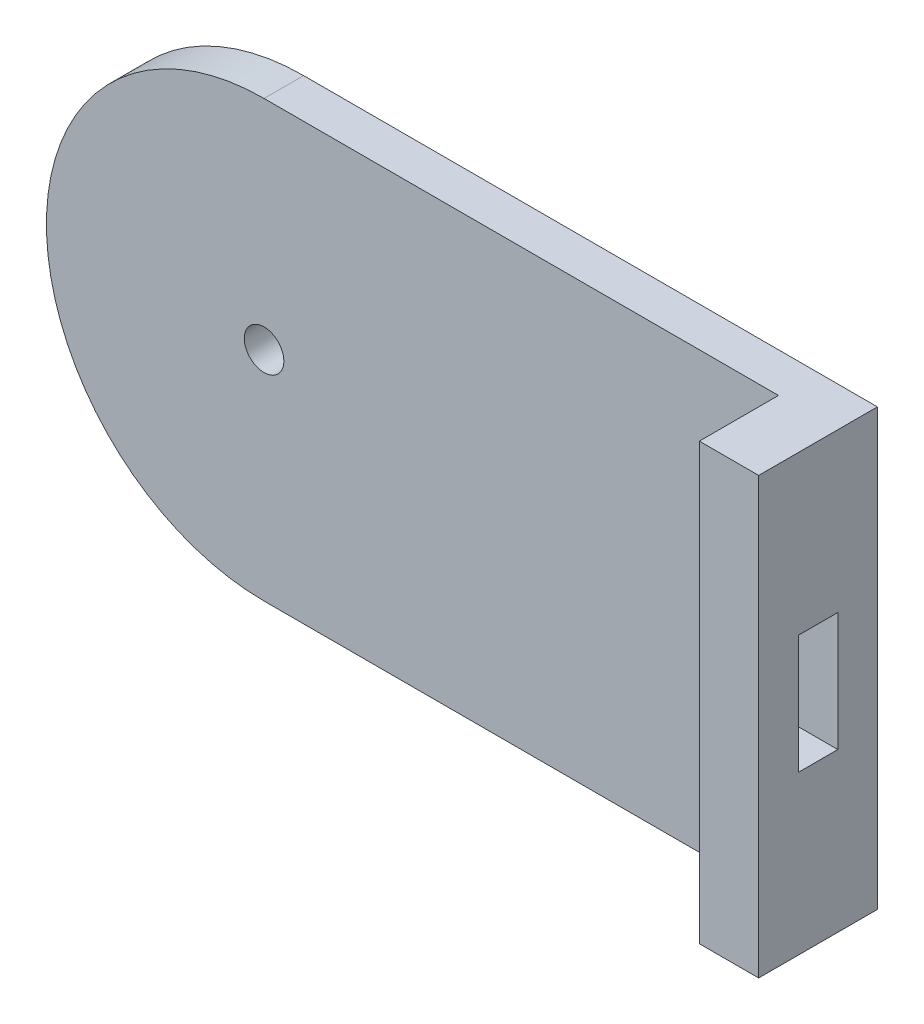
ISO-10303-21;
HEADER;
FILE_DESCRIPTION(('STEP AP214'),'2;1');
FILE_NAME('part.step','',(''),(''),'','','');
FILE_SCHEMA(('AUTOMOTIVE_DESIGN { 1 0 10303 214 1 1 1 1 }'));
ENDSEC;
DATA;
#1=APPLICATION_CONTEXT('core data for automotive mechanical design processes');
#2=APPLICATION_PROTOCOL_DEFINITION('international standard','automotive_design',2000,#1);
#3=PRODUCT_CONTEXT('',#1,'mechanical');
#4=PRODUCT('Part','Part','',(#3));
#5=PRODUCT_RELATED_PRODUCT_CATEGORY('part','',(#4));
#6=PRODUCT_DEFINITION_FORMATION('','',#4);
#7=PRODUCT_DEFINITION_CONTEXT('part definition',#1,'design');
#8=PRODUCT_DEFINITION('design','',#6,#7);
#9=PRODUCT_DEFINITION_SHAPE('','',#8);
#10=(LENGTH_UNIT() NAMED_UNIT(*) SI_UNIT(.MILLI.,.METRE.));
#11=(NAMED_UNIT(*) PLANE_ANGLE_UNIT() SI_UNIT($,.RADIAN.));
#12=(NAMED_UNIT(*) SI_UNIT($,.STERADIAN.) SOLID_ANGLE_UNIT());
#13=UNCERTAINTY_MEASURE_WITH_UNIT(LENGTH_MEASURE(1.E-05),#10,'distance_accuracy_value','');
#14=(GEOMETRIC_REPRESENTATION_CONTEXT(3) GLOBAL_UNCERTAINTY_ASSIGNED_CONTEXT((#13)) GLOBAL_UNIT_ASSIGNED_CONTEXT((#10,
#11,#12)) REPRESENTATION_CONTEXT('',''));
#15=CARTESIAN_POINT('',(0.,0.,0.));
#16=DIRECTION('',(0.,0.,1.));
#17=DIRECTION('',(1.,0.,0.));
#18=AXIS2_PLACEMENT_3D('',#15,#16,#17);
#19=CARTESIAN_POINT('',(-59.8184613478966,-27.822605838421,-10.));
#20=DIRECTION('',(0.,0.,1.));
#21=DIRECTION('',(1.,0.,0.));
#22=AXIS2_PLACEMENT_3D('',#19,#20,#21);
#23=CYLINDRICAL_SURFACE('',#22,55.);
#24=CARTESIAN_POINT('',(-59.8184613478966,-27.822605838421,0.));
#25=DIRECTION('',(0.,0.,1.));
#26=DIRECTION('',(1.,0.,0.));
#27=AXIS2_PLACEMENT_3D('',#24,#25,#26);
#28=CIRCLE('',#27,55.);
#29=CARTESIAN_POINT('',(-59.8184613478966,-82.822605838421,0.));
#30=VERTEX_POINT('',#29);
#31=CARTESIAN_POINT('',(-59.8184613478966,27.177394161579,0.));
#32=VERTEX_POINT('',#31);
#33=EDGE_CURVE('E196',#30,#32,#28,.F.);
#34=ORIENTED_EDGE('',*,*,#33,.T.);
#35=DIRECTION('',(0.,0.,1.));
#36=VECTOR('',#35,1.);
#37=CARTESIAN_POINT('',(-59.8184613478966,27.177394161579,-10.));
#38=LINE('',#37,#36);
#39=CARTESIAN_POINT('',(-59.8184613478966,27.177394161579,-10.));
#40=VERTEX_POINT('',#39);
#41=EDGE_CURVE('E165',#40,#32,#38,.T.);
#42=ORIENTED_EDGE('',*,*,#41,.F.);
#43=CARTESIAN_POINT('',(-59.8184613478966,-27.822605838421,-10.));
#44=DIRECTION('',(0.,0.,1.));
#45=DIRECTION('',(1.,0.,0.));
#46=AXIS2_PLACEMENT_3D('',#43,#44,#45);
#47=CIRCLE('',#46,55.);
#48=CARTESIAN_POINT('',(-59.8184613478966,-82.822605838421,-10.));
#49=VERTEX_POINT('',#48);
#50=EDGE_CURVE('E155',#49,#40,#47,.F.);
#51=ORIENTED_EDGE('',*,*,#50,.F.);
#52=DIRECTION('',(0.,0.,1.));
#53=VECTOR('',#52,1.);
#54=CARTESIAN_POINT('',(-59.8184613478966,-82.822605838421,-10.));
#55=LINE('',#54,#53);
#56=EDGE_CURVE('E200',#49,#30,#55,.T.);
#57=ORIENTED_EDGE('',*,*,#56,.T.);
#58=EDGE_LOOP('',(#34,#42,#51,#57));
#59=FACE_BOUND('',#58,.T.);
#60=ADVANCED_FACE('F34',(#59),#23,.T.);
#61=CARTESIAN_POINT('',(0.,27.177394161579,-10.));
#62=DIRECTION('',(0.,-1.,0.));
#63=DIRECTION('',(1.,0.,0.));
#64=AXIS2_PLACEMENT_3D('',#61,#62,#63);
#65=PLANE('',#64);
#66=DIRECTION('',(1.,0.,0.));
#67=VECTOR('',#66,1.);
#68=CARTESIAN_POINT('',(0.,27.177394161579,0.));
#69=LINE('',#68,#67);
#70=CARTESIAN_POINT('',(70.1815386521034,27.177394161579,0.));
#71=VERTEX_POINT('',#70);
#72=EDGE_CURVE('E205',#32,#71,#69,.T.);
#73=ORIENTED_EDGE('',*,*,#72,.T.);
#74=DIRECTION('',(0.,0.,-1.));
#75=VECTOR('',#74,1.);
#76=CARTESIAN_POINT('',(70.1815386521034,27.177394161579,20.));
#77=LINE('',#76,#75);
#78=CARTESIAN_POINT('',(70.1815386521034,27.177394161579,20.));
#79=VERTEX_POINT('',#78);
#80=EDGE_CURVE('E203',#79,#71,#77,.T.);
#81=ORIENTED_EDGE('',*,*,#80,.F.);
#82=DIRECTION('',(1.,0.,0.));
#83=VECTOR('',#82,1.);
#84=CARTESIAN_POINT('',(0.,27.177394161579,20.));
#85=LINE('',#84,#83);
#86=CARTESIAN_POINT('',(85.1815386521033,27.177394161579,20.));
#87=VERTEX_POINT('',#86);
#88=EDGE_CURVE('E140',#79,#87,#85,.T.);
#89=ORIENTED_EDGE('',*,*,#88,.T.);
#90=DIRECTION('',(0.,0.,1.));
#91=VECTOR('',#90,1.);
#92=CARTESIAN_POINT('',(85.1815386521033,27.177394161579,-10.));
#93=LINE('',#92,#91);
#94=CARTESIAN_POINT('',(85.1815386521033,27.177394161579,-10.));
#95=VERTEX_POINT('',#94);
#96=EDGE_CURVE('E232',#95,#87,#93,.T.);
#97=ORIENTED_EDGE('',*,*,#96,.F.);
#98=DIRECTION('',(1.,0.,0.));
#99=VECTOR('',#98,1.);
#100=CARTESIAN_POINT('',(0.,27.177394161579,-10.));
#101=LINE('',#100,#99);
#102=EDGE_CURVE('E234',#40,#95,#101,.T.);
#103=ORIENTED_EDGE('',*,*,#102,.F.);
#104=ORIENTED_EDGE('',*,*,#41,.T.);
#105=EDGE_LOOP('',(#73,#81,#89,#97,#103,#104));
#106=FACE_BOUND('',#105,.T.);
#107=ADVANCED_FACE('F185',(#106),#65,.F.);
#108=CARTESIAN_POINT('',(85.1815386521033,0.,-10.));
#109=DIRECTION('',(-1.,0.,0.));
#110=DIRECTION('',(0.,-1.,0.));
#111=AXIS2_PLACEMENT_3D('',#108,#109,#110);
#112=PLANE('',#111);
#113=DIRECTION('',(0.,1.,0.));
#114=VECTOR('',#113,1.);
#115=CARTESIAN_POINT('',(85.1815386521034,-42.822605838421,0.));
#116=LINE('',#115,#114);
#117=CARTESIAN_POINT('',(85.1815386521034,-42.822605838421,0.));
#118=VERTEX_POINT('',#117);
#119=CARTESIAN_POINT('',(85.1815386521033,-12.822605838421,0.));
#120=VERTEX_POINT('',#119);
#121=EDGE_CURVE('E121',#118,#120,#116,.T.);
#122=ORIENTED_EDGE('',*,*,#121,.F.);
#123=DIRECTION('',(0.,0.,-1.));
#124=VECTOR('',#123,1.);
#125=CARTESIAN_POINT('',(85.1815386521034,-42.822605838421,10.));
#126=LINE('',#125,#124);
#127=CARTESIAN_POINT('',(85.1815386521034,-42.822605838421,10.));
#128=VERTEX_POINT('',#127);
#129=EDGE_CURVE('E48',#128,#118,#126,.T.);
#130=ORIENTED_EDGE('',*,*,#129,.F.);
#131=DIRECTION('',(0.,-1.,0.));
#132=VECTOR('',#131,1.);
#133=CARTESIAN_POINT('',(85.1815386521033,-12.822605838421,10.));
#134=LINE('',#133,#132);
#135=CARTESIAN_POINT('',(85.1815386521033,-12.822605838421,10.));
#136=VERTEX_POINT('',#135);
#137=EDGE_CURVE('E130',#136,#128,#134,.T.);
#138=ORIENTED_EDGE('',*,*,#137,.F.);
#139=DIRECTION('',(0.,0.,1.));
#140=VECTOR('',#139,1.);
#141=CARTESIAN_POINT('',(85.1815386521033,-12.822605838421,10.));
#142=LINE('',#141,#140);
#143=EDGE_CURVE('E112',#120,#136,#142,.T.);
#144=ORIENTED_EDGE('',*,*,#143,.F.);
#145=EDGE_LOOP('',(#122,#130,#138,#144));
#146=FACE_BOUND('',#145,.T.);
#147=ORIENTED_EDGE('',*,*,#96,.T.);
#148=DIRECTION('',(0.,-1.,0.));
#149=VECTOR('',#148,1.);
#150=CARTESIAN_POINT('',(85.1815386521033,0.,20.));
#151=LINE('',#150,#149);
#152=CARTESIAN_POINT('',(85.1815386521034,-82.822605838421,20.));
#153=VERTEX_POINT('',#152);
#154=EDGE_CURVE('E149',#87,#153,#151,.T.);
#155=ORIENTED_EDGE('',*,*,#154,.T.);
#156=DIRECTION('',(0.,0.,1.));
#157=VECTOR('',#156,1.);
#158=CARTESIAN_POINT('',(85.1815386521034,-82.822605838421,-10.));
#159=LINE('',#158,#157);
#160=CARTESIAN_POINT('',(85.1815386521034,-82.822605838421,-10.));
#161=VERTEX_POINT('',#160);
#162=EDGE_CURVE('E237',#161,#153,#159,.T.);
#163=ORIENTED_EDGE('',*,*,#162,.F.);
#164=DIRECTION('',(0.,-1.,0.));
#165=VECTOR('',#164,1.);
#166=CARTESIAN_POINT('',(85.1815386521033,0.,-10.));
#167=LINE('',#166,#165);
#168=EDGE_CURVE('E244',#95,#161,#167,.T.);
#169=ORIENTED_EDGE('',*,*,#168,.F.);
#170=EDGE_LOOP('',(#147,#155,#163,#169));
#171=FACE_BOUND('',#170,.T.);
#172=ADVANCED_FACE('F127',(#146,#171),#112,.F.);
#173=CARTESIAN_POINT('',(0.,-82.822605838421,-10.));
#174=DIRECTION('',(0.,1.,0.));
#175=DIRECTION('',(-1.,0.,0.));
#176=AXIS2_PLACEMENT_3D('',#173,#174,#175);
#177=PLANE('',#176);
#178=ORIENTED_EDGE('',*,*,#162,.T.);
#179=DIRECTION('',(-1.,0.,0.));
#180=VECTOR('',#179,1.);
#181=CARTESIAN_POINT('',(0.,-82.822605838421,20.));
#182=LINE('',#181,#180);
#183=CARTESIAN_POINT('',(70.1815386521034,-82.822605838421,20.));
#184=VERTEX_POINT('',#183);
#185=EDGE_CURVE('E146',#153,#184,#182,.T.);
#186=ORIENTED_EDGE('',*,*,#185,.T.);
#187=DIRECTION('',(0.,0.,-1.));
#188=VECTOR('',#187,1.);
#189=CARTESIAN_POINT('',(70.1815386521034,-82.822605838421,20.));
#190=LINE('',#189,#188);
#191=CARTESIAN_POINT('',(70.1815386521034,-82.822605838421,0.));
#192=VERTEX_POINT('',#191);
#193=EDGE_CURVE('E152',#184,#192,#190,.T.);
#194=ORIENTED_EDGE('',*,*,#193,.T.);
#195=DIRECTION('',(-1.,0.,0.));
#196=VECTOR('',#195,1.);
#197=CARTESIAN_POINT('',(0.,-82.822605838421,0.));
#198=LINE('',#197,#196);
#199=EDGE_CURVE('E202',#192,#30,#198,.T.);
#200=ORIENTED_EDGE('',*,*,#199,.T.);
#201=ORIENTED_EDGE('',*,*,#56,.F.);
#202=DIRECTION('',(-1.,0.,0.));
#203=VECTOR('',#202,1.);
#204=CARTESIAN_POINT('',(0.,-82.822605838421,-10.));
#205=LINE('',#204,#203);
#206=EDGE_CURVE('E246',#161,#49,#205,.T.);
#207=ORIENTED_EDGE('',*,*,#206,.F.);
#208=EDGE_LOOP('',(#178,#186,#194,#200,#201,#207));
#209=FACE_BOUND('',#208,.T.);
#210=ADVANCED_FACE('F226',(#209),#177,.F.);
#211=CARTESIAN_POINT('',(-59.8184613478966,-27.822605838421,-10.));
#212=DIRECTION('',(0.,0.,1.));
#213=DIRECTION('',(1.,0.,0.));
#214=AXIS2_PLACEMENT_3D('',#211,#212,#213);
#215=CYLINDRICAL_SURFACE('',#214,5.);
#216=CARTESIAN_POINT('',(-59.8184613478966,-27.822605838421,-10.));
#217=DIRECTION('',(0.,0.,1.));
#218=DIRECTION('',(1.,0.,0.));
#219=AXIS2_PLACEMENT_3D('',#216,#217,#218);
#220=CIRCLE('',#219,5.);
#221=CARTESIAN_POINT('',(-54.8184613478966,-27.822605838421,-10.));
#222=VERTEX_POINT('',#221);
#223=EDGE_CURVE('E210',#222,#222,#220,.T.);
#224=ORIENTED_EDGE('',*,*,#223,.F.);
#225=EDGE_LOOP('',(#224));
#226=FACE_BOUND('',#225,.T.);
#227=CARTESIAN_POINT('',(-59.8184613478966,-27.822605838421,0.));
#228=DIRECTION('',(0.,0.,1.));
#229=DIRECTION('',(1.,0.,0.));
#230=AXIS2_PLACEMENT_3D('',#227,#228,#229);
#231=CIRCLE('',#230,5.);
#232=CARTESIAN_POINT('',(-54.8184613478966,-27.822605838421,0.));
#233=VERTEX_POINT('',#232);
#234=EDGE_CURVE('E221',#233,#233,#231,.T.);
#235=ORIENTED_EDGE('',*,*,#234,.T.);
#236=EDGE_LOOP('',(#235));
#237=FACE_BOUND('',#236,.T.);
#238=ADVANCED_FACE('F251',(#226,#237),#215,.F.);
#239=CARTESIAN_POINT('',(0.,0.,-10.));
#240=DIRECTION('',(0.,0.,1.));
#241=DIRECTION('',(1.,0.,0.));
#242=AXIS2_PLACEMENT_3D('',#239,#240,#241);
#243=PLANE('',#242);
#244=ORIENTED_EDGE('',*,*,#50,.T.);
#245=ORIENTED_EDGE('',*,*,#102,.T.);
#246=ORIENTED_EDGE('',*,*,#168,.T.);
#247=ORIENTED_EDGE('',*,*,#206,.T.);
#248=EDGE_LOOP('',(#244,#245,#246,#247));
#249=FACE_BOUND('',#248,.T.);
#250=ORIENTED_EDGE('',*,*,#223,.T.);
#251=EDGE_LOOP('',(#250));
#252=FACE_BOUND('',#251,.T.);
#253=ADVANCED_FACE('F253',(#249,#252),#243,.F.);
#254=CARTESIAN_POINT('',(0.,0.,0.));
#255=DIRECTION('',(0.,0.,1.));
#256=DIRECTION('',(1.,0.,0.));
#257=AXIS2_PLACEMENT_3D('',#254,#255,#256);
#258=PLANE('',#257);
#259=DIRECTION('',(0.,-1.,0.));
#260=VECTOR('',#259,1.);
#261=CARTESIAN_POINT('',(70.1815386521033,0.,0.));
#262=LINE('',#261,#260);
#263=CARTESIAN_POINT('',(70.1815386521034,-42.822605838421,0.));
#264=VERTEX_POINT('',#263);
#265=EDGE_CURVE('E137',#264,#192,#262,.T.);
#266=ORIENTED_EDGE('',*,*,#265,.F.);
#267=DIRECTION('',(1.,0.,0.));
#268=VECTOR('',#267,1.);
#269=CARTESIAN_POINT('',(65.1815386521034,-42.822605838421,0.));
#270=LINE('',#269,#268);
#271=EDGE_CURVE('E118',#264,#118,#270,.T.);
#272=ORIENTED_EDGE('',*,*,#271,.T.);
#273=ORIENTED_EDGE('',*,*,#121,.T.);
#274=DIRECTION('',(1.,0.,0.));
#275=VECTOR('',#274,1.);
#276=CARTESIAN_POINT('',(65.1815386521033,-12.822605838421,0.));
#277=LINE('',#276,#275);
#278=CARTESIAN_POINT('',(70.1815386521033,-12.822605838421,0.));
#279=VERTEX_POINT('',#278);
#280=EDGE_CURVE('E56',#279,#120,#277,.T.);
#281=ORIENTED_EDGE('',*,*,#280,.F.);
#282=EDGE_CURVE('E144',#71,#279,#262,.T.);
#283=ORIENTED_EDGE('',*,*,#282,.F.);
#284=ORIENTED_EDGE('',*,*,#72,.F.);
#285=ORIENTED_EDGE('',*,*,#33,.F.);
#286=ORIENTED_EDGE('',*,*,#199,.F.);
#287=EDGE_LOOP('',(#266,#272,#273,#281,#283,#284,#285,#286));
#288=FACE_BOUND('',#287,.T.);
#289=ORIENTED_EDGE('',*,*,#234,.F.);
#290=EDGE_LOOP('',(#289));
#291=FACE_BOUND('',#290,.T.);
#292=ADVANCED_FACE('F123',(#288,#291),#258,.T.);
#293=CARTESIAN_POINT('',(70.1815386521033,0.,20.));
#294=DIRECTION('',(1.,0.,0.));
#295=DIRECTION('',(0.,1.,0.));
#296=AXIS2_PLACEMENT_3D('',#293,#294,#295);
#297=PLANE('',#296);
#298=DIRECTION('',(0.,-1.,0.));
#299=VECTOR('',#298,1.);
#300=CARTESIAN_POINT('',(70.1815386521033,0.,10.));
#301=LINE('',#300,#299);
#302=CARTESIAN_POINT('',(70.1815386521033,-12.822605838421,10.));
#303=VERTEX_POINT('',#302);
#304=CARTESIAN_POINT('',(70.1815386521034,-42.822605838421,10.));
#305=VERTEX_POINT('',#304);
#306=EDGE_CURVE('E41',#303,#305,#301,.T.);
#307=ORIENTED_EDGE('',*,*,#306,.T.);
#308=DIRECTION('',(0.,0.,-1.));
#309=VECTOR('',#308,1.);
#310=CARTESIAN_POINT('',(70.1815386521034,-42.822605838421,20.));
#311=LINE('',#310,#309);
#312=EDGE_CURVE('E11',#305,#264,#311,.T.);
#313=ORIENTED_EDGE('',*,*,#312,.T.);
#314=ORIENTED_EDGE('',*,*,#265,.T.);
#315=ORIENTED_EDGE('',*,*,#193,.F.);
#316=DIRECTION('',(0.,-1.,0.));
#317=VECTOR('',#316,1.);
#318=CARTESIAN_POINT('',(70.1815386521033,0.,20.));
#319=LINE('',#318,#317);
#320=EDGE_CURVE('E143',#79,#184,#319,.T.);
#321=ORIENTED_EDGE('',*,*,#320,.F.);
#322=ORIENTED_EDGE('',*,*,#80,.T.);
#323=ORIENTED_EDGE('',*,*,#282,.T.);
#324=DIRECTION('',(0.,0.,1.));
#325=VECTOR('',#324,1.);
#326=CARTESIAN_POINT('',(70.1815386521033,-12.822605838421,20.));
#327=LINE('',#326,#325);
#328=EDGE_CURVE('E115',#279,#303,#327,.T.);
#329=ORIENTED_EDGE('',*,*,#328,.T.);
#330=EDGE_LOOP('',(#307,#313,#314,#315,#321,#322,#323,#329));
#331=FACE_BOUND('',#330,.T.);
#332=ADVANCED_FACE('F168',(#331),#297,.F.);
#333=CARTESIAN_POINT('',(0.,0.,20.));
#334=DIRECTION('',(0.,0.,1.));
#335=DIRECTION('',(1.,0.,0.));
#336=AXIS2_PLACEMENT_3D('',#333,#334,#335);
#337=PLANE('',#336);
#338=ORIENTED_EDGE('',*,*,#88,.F.);
#339=ORIENTED_EDGE('',*,*,#320,.T.);
#340=ORIENTED_EDGE('',*,*,#185,.F.);
#341=ORIENTED_EDGE('',*,*,#154,.F.);
#342=EDGE_LOOP('',(#338,#339,#340,#341));
#343=FACE_BOUND('',#342,.T.);
#344=ADVANCED_FACE('F174',(#343),#337,.T.);
#345=CARTESIAN_POINT('',(65.1815386521034,-42.822605838421,10.));
#346=DIRECTION('',(0.,-1.,0.));
#347=DIRECTION('',(1.,0.,0.));
#348=AXIS2_PLACEMENT_3D('',#345,#346,#347);
#349=PLANE('',#348);
#350=DIRECTION('',(1.,0.,0.));
#351=VECTOR('',#350,1.);
#352=CARTESIAN_POINT('',(65.1815386521034,-42.822605838421,10.));
#353=LINE('',#352,#351);
#354=EDGE_CURVE('E135',#305,#128,#353,.T.);
#355=ORIENTED_EDGE('',*,*,#354,.T.);
#356=ORIENTED_EDGE('',*,*,#129,.T.);
#357=ORIENTED_EDGE('',*,*,#271,.F.);
#358=ORIENTED_EDGE('',*,*,#312,.F.);
#359=EDGE_LOOP('',(#355,#356,#357,#358));
#360=FACE_BOUND('',#359,.T.);
#361=ADVANCED_FACE('F172',(#360),#349,.F.);
#362=CARTESIAN_POINT('',(65.1815386521033,-12.822605838421,10.));
#363=DIRECTION('',(0.,0.,1.));
#364=DIRECTION('',(1.,0.,0.));
#365=AXIS2_PLACEMENT_3D('',#362,#363,#364);
#366=PLANE('',#365);
#367=DIRECTION('',(1.,0.,0.));
#368=VECTOR('',#367,1.);
#369=CARTESIAN_POINT('',(65.1815386521033,-12.822605838421,10.));
#370=LINE('',#369,#368);
#371=EDGE_CURVE('E117',#303,#136,#370,.T.);
#372=ORIENTED_EDGE('',*,*,#371,.T.);
#373=ORIENTED_EDGE('',*,*,#137,.T.);
#374=ORIENTED_EDGE('',*,*,#354,.F.);
#375=ORIENTED_EDGE('',*,*,#306,.F.);
#376=EDGE_LOOP('',(#372,#373,#374,#375));
#377=FACE_BOUND('',#376,.T.);
#378=ADVANCED_FACE('F171',(#377),#366,.F.);
#379=CARTESIAN_POINT('',(65.1815386521033,-12.822605838421,10.));
#380=DIRECTION('',(0.,1.,0.));
#381=DIRECTION('',(-1.,0.,0.));
#382=AXIS2_PLACEMENT_3D('',#379,#380,#381);
#383=PLANE('',#382);
#384=ORIENTED_EDGE('',*,*,#280,.T.);
#385=ORIENTED_EDGE('',*,*,#143,.T.);
#386=ORIENTED_EDGE('',*,*,#371,.F.);
#387=ORIENTED_EDGE('',*,*,#328,.F.);
#388=EDGE_LOOP('',(#384,#385,#386,#387));
#389=FACE_BOUND('',#388,.T.);
#390=ADVANCED_FACE('F109',(#389),#383,.F.);
#391=CLOSED_SHELL('',(#60,#107,#172,#210,#238,#253,#292,#332,#344,#361,#378,#390));
#392=MANIFOLD_SOLID_BREP('B2',#391);
#393=ADVANCED_BREP_SHAPE_REPRESENTATION('',(#18,#392),#14);
#394=SHAPE_DEFINITION_REPRESENTATION(#9,#393);
ENDSEC;
END-ISO-10303-21;
